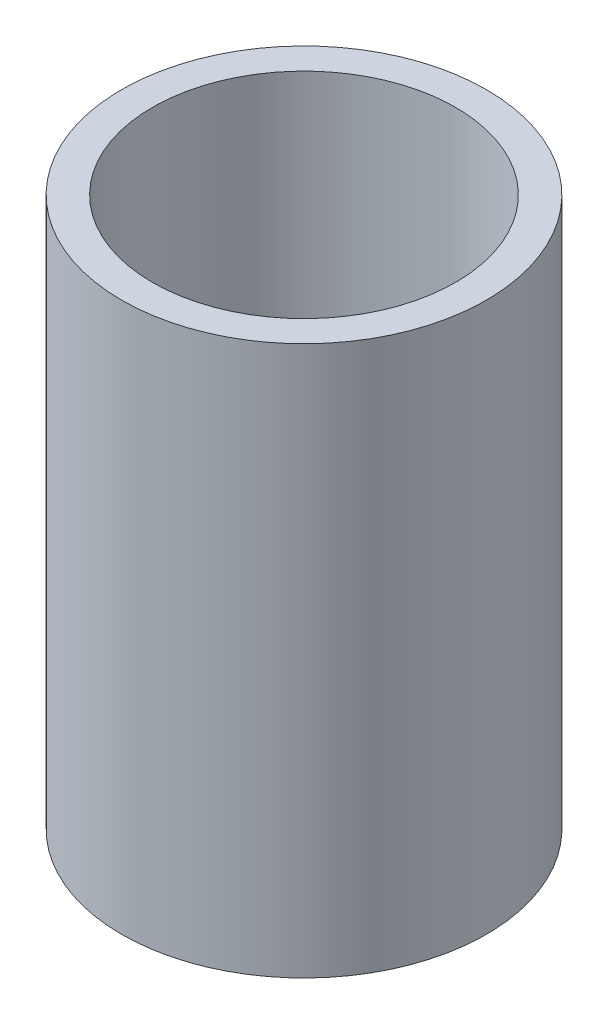
ISO-10303-21;
HEADER;
FILE_DESCRIPTION(('STEP AP214'),'2;1');
FILE_NAME('part.step','',(''),(''),'','','');
FILE_SCHEMA(('AUTOMOTIVE_DESIGN { 1 0 10303 214 1 1 1 1 }'));
ENDSEC;
DATA;
#1=APPLICATION_CONTEXT('core data for automotive mechanical design processes');
#2=APPLICATION_PROTOCOL_DEFINITION('international standard','automotive_design',2000,#1);
#3=PRODUCT_CONTEXT('',#1,'mechanical');
#4=PRODUCT('Part','Part','',(#3));
#5=PRODUCT_RELATED_PRODUCT_CATEGORY('part','',(#4));
#6=PRODUCT_DEFINITION_FORMATION('','',#4);
#7=PRODUCT_DEFINITION_CONTEXT('part definition',#1,'design');
#8=PRODUCT_DEFINITION('design','',#6,#7);
#9=PRODUCT_DEFINITION_SHAPE('','',#8);
#10=(LENGTH_UNIT() NAMED_UNIT(*) SI_UNIT(.MILLI.,.METRE.));
#11=(NAMED_UNIT(*) PLANE_ANGLE_UNIT() SI_UNIT($,.RADIAN.));
#12=(NAMED_UNIT(*) SI_UNIT($,.STERADIAN.) SOLID_ANGLE_UNIT());
#13=UNCERTAINTY_MEASURE_WITH_UNIT(LENGTH_MEASURE(1.E-05),#10,'distance_accuracy_value','');
#14=(GEOMETRIC_REPRESENTATION_CONTEXT(3) GLOBAL_UNCERTAINTY_ASSIGNED_CONTEXT((#13)) GLOBAL_UNIT_ASSIGNED_CONTEXT((#10,
#11,#12)) REPRESENTATION_CONTEXT('',''));
#15=CARTESIAN_POINT('',(0.,0.,0.));
#16=DIRECTION('',(0.,0.,1.));
#17=DIRECTION('',(1.,0.,0.));
#18=AXIS2_PLACEMENT_3D('',#15,#16,#17);
#19=CARTESIAN_POINT('',(0.,63.5,0.));
#20=DIRECTION('',(0.,1.,0.));
#21=DIRECTION('',(0.,0.,1.));
#22=AXIS2_PLACEMENT_3D('',#19,#20,#21);
#23=PLANE('',#22);
#24=CARTESIAN_POINT('',(0.,63.5,0.));
#25=DIRECTION('',(0.,1.,0.));
#26=DIRECTION('',(0.,0.,1.));
#27=AXIS2_PLACEMENT_3D('',#24,#25,#26);
#28=CIRCLE('',#27,21.082);
#29=CARTESIAN_POINT('',(0.,63.5,21.082));
#30=VERTEX_POINT('',#29);
#31=EDGE_CURVE('E10',#30,#30,#28,.T.);
#32=ORIENTED_EDGE('',*,*,#31,.T.);
#33=EDGE_LOOP('',(#32));
#34=FACE_BOUND('',#33,.T.);
#35=CARTESIAN_POINT('',(0.,63.5,0.));
#36=DIRECTION('',(0.,1.,0.));
#37=DIRECTION('',(0.,0.,1.));
#38=AXIS2_PLACEMENT_3D('',#35,#36,#37);
#39=CIRCLE('',#38,17.526);
#40=CARTESIAN_POINT('',(0.,63.5,17.526));
#41=VERTEX_POINT('',#40);
#42=EDGE_CURVE('E42',#41,#41,#39,.T.);
#43=ORIENTED_EDGE('',*,*,#42,.F.);
#44=EDGE_LOOP('',(#43));
#45=FACE_BOUND('',#44,.T.);
#46=ADVANCED_FACE('F31',(#34,#45),#23,.T.);
#47=CARTESIAN_POINT('',(0.,0.,0.));
#48=DIRECTION('',(0.,1.,0.));
#49=DIRECTION('',(0.,0.,1.));
#50=AXIS2_PLACEMENT_3D('',#47,#48,#49);
#51=PLANE('',#50);
#52=CARTESIAN_POINT('',(0.,0.,0.));
#53=DIRECTION('',(0.,1.,0.));
#54=DIRECTION('',(0.,0.,1.));
#55=AXIS2_PLACEMENT_3D('',#52,#53,#54);
#56=CIRCLE('',#55,21.082);
#57=CARTESIAN_POINT('',(0.,0.,21.082));
#58=VERTEX_POINT('',#57);
#59=EDGE_CURVE('E35',#58,#58,#56,.T.);
#60=ORIENTED_EDGE('',*,*,#59,.F.);
#61=EDGE_LOOP('',(#60));
#62=FACE_BOUND('',#61,.T.);
#63=CARTESIAN_POINT('',(0.,0.,0.));
#64=DIRECTION('',(0.,1.,0.));
#65=DIRECTION('',(0.,0.,1.));
#66=AXIS2_PLACEMENT_3D('',#63,#64,#65);
#67=CIRCLE('',#66,17.526);
#68=CARTESIAN_POINT('',(0.,0.,17.526));
#69=VERTEX_POINT('',#68);
#70=EDGE_CURVE('E44',#69,#69,#67,.T.);
#71=ORIENTED_EDGE('',*,*,#70,.T.);
#72=EDGE_LOOP('',(#71));
#73=FACE_BOUND('',#72,.T.);
#74=ADVANCED_FACE('F54',(#62,#73),#51,.F.);
#75=CARTESIAN_POINT('',(0.,63.5,0.));
#76=DIRECTION('',(0.,-1.,0.));
#77=DIRECTION('',(0.,0.,-1.));
#78=AXIS2_PLACEMENT_3D('',#75,#76,#77);
#79=CYLINDRICAL_SURFACE('',#78,21.082);
#80=ORIENTED_EDGE('',*,*,#31,.F.);
#81=EDGE_LOOP('',(#80));
#82=FACE_BOUND('',#81,.T.);
#83=ORIENTED_EDGE('',*,*,#59,.T.);
#84=EDGE_LOOP('',(#83));
#85=FACE_BOUND('',#84,.T.);
#86=ADVANCED_FACE('F33',(#82,#85),#79,.T.);
#87=CARTESIAN_POINT('',(0.,63.5,0.));
#88=DIRECTION('',(0.,-1.,0.));
#89=DIRECTION('',(0.,0.,-1.));
#90=AXIS2_PLACEMENT_3D('',#87,#88,#89);
#91=CYLINDRICAL_SURFACE('',#90,17.526);
#92=ORIENTED_EDGE('',*,*,#42,.T.);
#93=EDGE_LOOP('',(#92));
#94=FACE_BOUND('',#93,.T.);
#95=ORIENTED_EDGE('',*,*,#70,.F.);
#96=EDGE_LOOP('',(#95));
#97=FACE_BOUND('',#96,.T.);
#98=ADVANCED_FACE('F50',(#94,#97),#91,.F.);
#99=CLOSED_SHELL('',(#46,#74,#86,#98));
#100=MANIFOLD_SOLID_BREP('B2',#99);
#101=ADVANCED_BREP_SHAPE_REPRESENTATION('',(#18,#100),#14);
#102=SHAPE_DEFINITION_REPRESENTATION(#9,#101);
ENDSEC;
END-ISO-10303-21;
